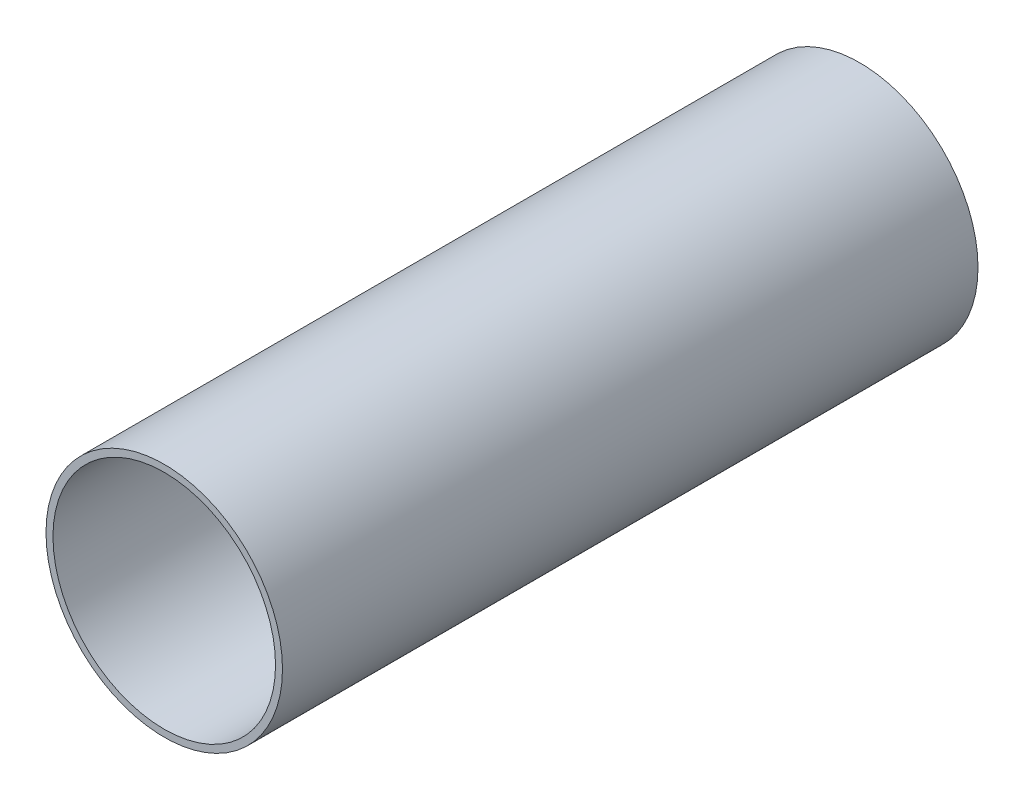
ISO-10303-21;
HEADER;
FILE_DESCRIPTION(('STEP AP214'),'2;1');
FILE_NAME('part.step','',(''),(''),'','','');
FILE_SCHEMA(('AUTOMOTIVE_DESIGN { 1 0 10303 214 1 1 1 1 }'));
ENDSEC;
DATA;
#1=APPLICATION_CONTEXT('core data for automotive mechanical design processes');
#2=APPLICATION_PROTOCOL_DEFINITION('international standard','automotive_design',2000,#1);
#3=PRODUCT_CONTEXT('',#1,'mechanical');
#4=PRODUCT('Part','Part','',(#3));
#5=PRODUCT_RELATED_PRODUCT_CATEGORY('part','',(#4));
#6=PRODUCT_DEFINITION_FORMATION('','',#4);
#7=PRODUCT_DEFINITION_CONTEXT('part definition',#1,'design');
#8=PRODUCT_DEFINITION('design','',#6,#7);
#9=PRODUCT_DEFINITION_SHAPE('','',#8);
#10=(LENGTH_UNIT() NAMED_UNIT(*) SI_UNIT(.MILLI.,.METRE.));
#11=(NAMED_UNIT(*) PLANE_ANGLE_UNIT() SI_UNIT($,.RADIAN.));
#12=(NAMED_UNIT(*) SI_UNIT($,.STERADIAN.) SOLID_ANGLE_UNIT());
#13=UNCERTAINTY_MEASURE_WITH_UNIT(LENGTH_MEASURE(1.E-05),#10,'distance_accuracy_value','');
#14=(GEOMETRIC_REPRESENTATION_CONTEXT(3) GLOBAL_UNCERTAINTY_ASSIGNED_CONTEXT((#13)) GLOBAL_UNIT_ASSIGNED_CONTEXT((#10,
#11,#12)) REPRESENTATION_CONTEXT('',''));
#15=CARTESIAN_POINT('',(0.,0.,0.));
#16=DIRECTION('',(0.,0.,1.));
#17=DIRECTION('',(1.,0.,0.));
#18=AXIS2_PLACEMENT_3D('',#15,#16,#17);
#19=CARTESIAN_POINT('',(0.,0.,-25.));
#20=DIRECTION('',(0.,0.,-1.));
#21=DIRECTION('',(1.,0.,0.));
#22=AXIS2_PLACEMENT_3D('',#19,#20,#21);
#23=PLANE('',#22);
#24=CARTESIAN_POINT('',(0.,0.,-25.));
#25=DIRECTION('',(0.,0.,1.));
#26=DIRECTION('',(1.,0.,0.));
#27=AXIS2_PLACEMENT_3D('',#24,#25,#26);
#28=CIRCLE('',#27,4.25);
#29=CARTESIAN_POINT('',(4.25,0.,-25.));
#30=VERTEX_POINT('',#29);
#31=EDGE_CURVE('E10',#30,#30,#28,.T.);
#32=ORIENTED_EDGE('',*,*,#31,.F.);
#33=EDGE_LOOP('',(#32));
#34=FACE_BOUND('',#33,.T.);
#35=CARTESIAN_POINT('',(0.,0.,-25.));
#36=DIRECTION('',(0.,0.,1.));
#37=DIRECTION('',(1.,0.,0.));
#38=AXIS2_PLACEMENT_3D('',#35,#36,#37);
#39=CIRCLE('',#38,4.);
#40=CARTESIAN_POINT('',(4.,0.,-25.));
#41=VERTEX_POINT('',#40);
#42=EDGE_CURVE('E44',#41,#41,#39,.T.);
#43=ORIENTED_EDGE('',*,*,#42,.T.);
#44=EDGE_LOOP('',(#43));
#45=FACE_BOUND('',#44,.T.);
#46=ADVANCED_FACE('F33',(#34,#45),#23,.T.);
#47=CARTESIAN_POINT('',(0.,0.,0.));
#48=DIRECTION('',(0.,0.,-1.));
#49=DIRECTION('',(1.,0.,0.));
#50=AXIS2_PLACEMENT_3D('',#47,#48,#49);
#51=PLANE('',#50);
#52=CARTESIAN_POINT('',(0.,0.,0.));
#53=DIRECTION('',(0.,0.,1.));
#54=DIRECTION('',(1.,0.,0.));
#55=AXIS2_PLACEMENT_3D('',#52,#53,#54);
#56=CIRCLE('',#55,4.25);
#57=CARTESIAN_POINT('',(4.25,0.,0.));
#58=VERTEX_POINT('',#57);
#59=EDGE_CURVE('E37',#58,#58,#56,.T.);
#60=ORIENTED_EDGE('',*,*,#59,.T.);
#61=EDGE_LOOP('',(#60));
#62=FACE_BOUND('',#61,.T.);
#63=CARTESIAN_POINT('',(0.,0.,0.));
#64=DIRECTION('',(0.,0.,1.));
#65=DIRECTION('',(1.,0.,0.));
#66=AXIS2_PLACEMENT_3D('',#63,#64,#65);
#67=CIRCLE('',#66,4.);
#68=CARTESIAN_POINT('',(4.,0.,0.));
#69=VERTEX_POINT('',#68);
#70=EDGE_CURVE('E46',#69,#69,#67,.T.);
#71=ORIENTED_EDGE('',*,*,#70,.F.);
#72=EDGE_LOOP('',(#71));
#73=FACE_BOUND('',#72,.T.);
#74=ADVANCED_FACE('F59',(#62,#73),#51,.F.);
#75=CARTESIAN_POINT('',(0.,0.,-25.));
#76=DIRECTION('',(0.,0.,1.));
#77=DIRECTION('',(-1.,0.,0.));
#78=AXIS2_PLACEMENT_3D('',#75,#76,#77);
#79=CYLINDRICAL_SURFACE('',#78,4.25);
#80=ORIENTED_EDGE('',*,*,#31,.T.);
#81=EDGE_LOOP('',(#80));
#82=FACE_BOUND('',#81,.T.);
#83=ORIENTED_EDGE('',*,*,#59,.F.);
#84=EDGE_LOOP('',(#83));
#85=FACE_BOUND('',#84,.T.);
#86=ADVANCED_FACE('F35',(#82,#85),#79,.T.);
#87=CARTESIAN_POINT('',(0.,0.,-25.));
#88=DIRECTION('',(0.,0.,1.));
#89=DIRECTION('',(-1.,0.,0.));
#90=AXIS2_PLACEMENT_3D('',#87,#88,#89);
#91=CYLINDRICAL_SURFACE('',#90,4.);
#92=ORIENTED_EDGE('',*,*,#42,.F.);
#93=EDGE_LOOP('',(#92));
#94=FACE_BOUND('',#93,.T.);
#95=ORIENTED_EDGE('',*,*,#70,.T.);
#96=EDGE_LOOP('',(#95));
#97=FACE_BOUND('',#96,.T.);
#98=ADVANCED_FACE('F53',(#94,#97),#91,.F.);
#99=CLOSED_SHELL('',(#46,#74,#86,#98));
#100=MANIFOLD_SOLID_BREP('B2',#99);
#101=ADVANCED_BREP_SHAPE_REPRESENTATION('',(#18,#100),#14);
#102=SHAPE_DEFINITION_REPRESENTATION(#9,#101);
ENDSEC;
END-ISO-10303-21;
